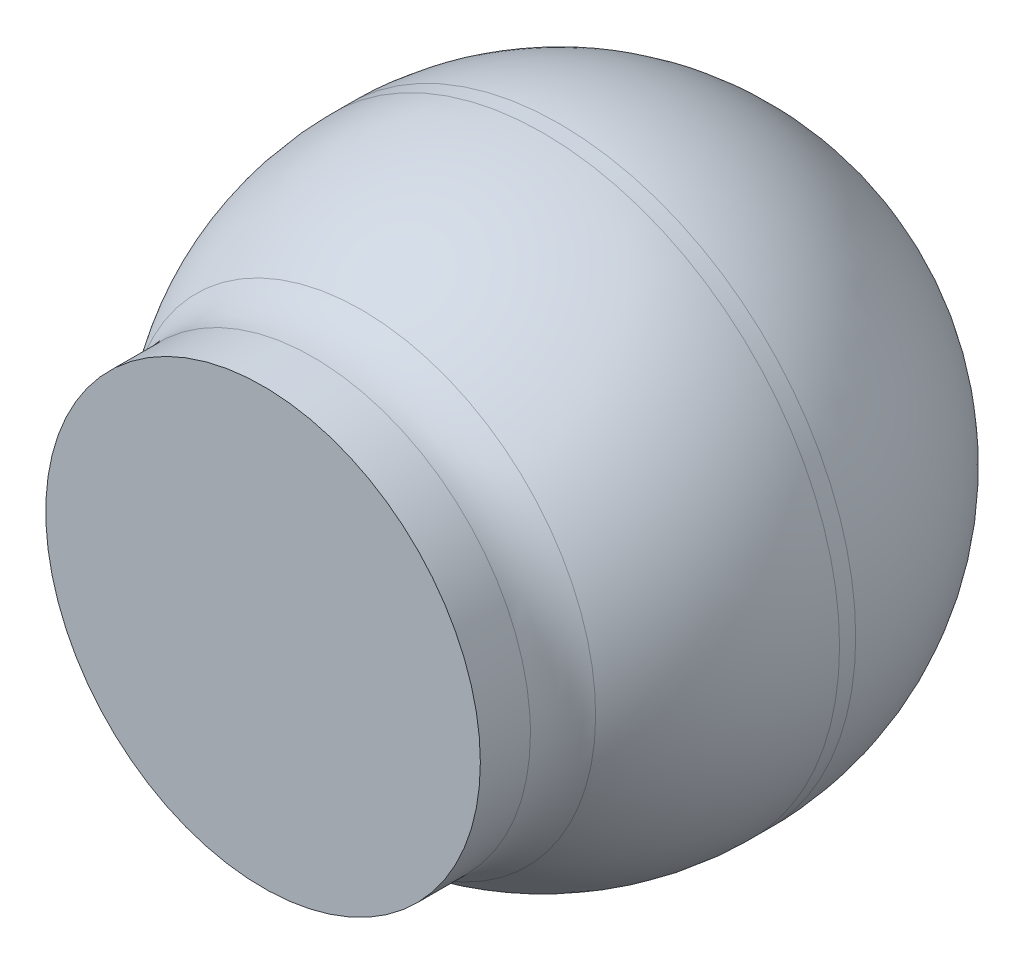
ISO-10303-21;
HEADER;
FILE_DESCRIPTION(('STEP AP214'),'2;1');
FILE_NAME('part.step','',(''),(''),'','','');
FILE_SCHEMA(('AUTOMOTIVE_DESIGN { 1 0 10303 214 1 1 1 1 }'));
ENDSEC;
DATA;
#1=APPLICATION_CONTEXT('core data for automotive mechanical design processes');
#2=APPLICATION_PROTOCOL_DEFINITION('international standard','automotive_design',2000,#1);
#3=PRODUCT_CONTEXT('',#1,'mechanical');
#4=PRODUCT('Part','Part','',(#3));
#5=PRODUCT_RELATED_PRODUCT_CATEGORY('part','',(#4));
#6=PRODUCT_DEFINITION_FORMATION('','',#4);
#7=PRODUCT_DEFINITION_CONTEXT('part definition',#1,'design');
#8=PRODUCT_DEFINITION('design','',#6,#7);
#9=PRODUCT_DEFINITION_SHAPE('','',#8);
#10=(LENGTH_UNIT() NAMED_UNIT(*) SI_UNIT(.MILLI.,.METRE.));
#11=(NAMED_UNIT(*) PLANE_ANGLE_UNIT() SI_UNIT($,.RADIAN.));
#12=(NAMED_UNIT(*) SI_UNIT($,.STERADIAN.) SOLID_ANGLE_UNIT());
#13=UNCERTAINTY_MEASURE_WITH_UNIT(LENGTH_MEASURE(1.E-05),#10,'distance_accuracy_value','');
#14=(GEOMETRIC_REPRESENTATION_CONTEXT(3) GLOBAL_UNCERTAINTY_ASSIGNED_CONTEXT((#13)) GLOBAL_UNIT_ASSIGNED_CONTEXT((#10,
#11,#12)) REPRESENTATION_CONTEXT('',''));
#15=CARTESIAN_POINT('',(0.,0.,0.));
#16=DIRECTION('',(0.,0.,1.));
#17=DIRECTION('',(1.,0.,0.));
#18=AXIS2_PLACEMENT_3D('',#15,#16,#17);
#19=CARTESIAN_POINT('',(-3.102919922269,-5.321349291452,10.006534503384));
#20=DIRECTION('',(0.,0.,-1.));
#21=DIRECTION('',(-1.,0.,0.));
#22=AXIS2_PLACEMENT_3D('',#19,#20,#21);
#23=PLANE('',#22);
#24=CARTESIAN_POINT('',(-3.102919922269,-5.321349291452,10.006534503384));
#25=DIRECTION('',(0.,0.,1.));
#26=DIRECTION('',(1.,0.,0.));
#27=AXIS2_PLACEMENT_3D('',#24,#25,#26);
#28=CIRCLE('',#27,0.275);
#29=CARTESIAN_POINT('',(-2.827919922269,-5.321349291452,10.006534503384));
#30=VERTEX_POINT('',#29);
#31=EDGE_CURVE('E20',#30,#30,#28,.F.);
#32=ORIENTED_EDGE('',*,*,#31,.F.);
#33=EDGE_LOOP('',(#32));
#34=FACE_BOUND('',#33,.T.);
#35=ADVANCED_FACE('F17',(#34),#23,.F.);
#36=CARTESIAN_POINT('',(-3.102919922269,-5.321349291452,9.906534503384));
#37=DIRECTION('',(0.,0.,1.));
#38=DIRECTION('',(1.,0.,0.));
#39=AXIS2_PLACEMENT_3D('',#36,#37,#38);
#40=CYLINDRICAL_SURFACE('',#39,0.275);
#41=CARTESIAN_POINT('',(-3.102919922269,-5.321349291452,9.943180457728));
#42=DIRECTION('',(0.,0.,-1.));
#43=DIRECTION('',(0.996700902337583,0.0811622527992439,0.));
#44=AXIS2_PLACEMENT_3D('',#41,#42,#43);
#45=CIRCLE('',#44,0.275);
#46=CARTESIAN_POINT('',(-2.82882717412616,-5.29902967193221,9.943180457728));
#47=VERTEX_POINT('',#46);
#48=EDGE_CURVE('E65',#47,#47,#45,.F.);
#49=ORIENTED_EDGE('',*,*,#48,.T.);
#50=EDGE_LOOP('',(#49));
#51=FACE_BOUND('',#50,.T.);
#52=ORIENTED_EDGE('',*,*,#31,.T.);
#53=EDGE_LOOP('',(#52));
#54=FACE_BOUND('',#53,.T.);
#55=ADVANCED_FACE('F62',(#51,#54),#40,.T.);
#56=CARTESIAN_POINT('',(-3.102919922269,-5.321349291452,9.943180457728));
#57=DIRECTION('',(0.,0.,-1.));
#58=DIRECTION('',(0.996700902337583,0.0811622527992448,0.));
#59=AXIS2_PLACEMENT_3D('',#56,#57,#58);
#60=TOROIDAL_SURFACE('',#59,0.375,0.1);
#61=ORIENTED_EDGE('',*,*,#48,.F.);
#62=EDGE_LOOP('',(#61));
#63=FACE_BOUND('',#62,.T.);
#64=CARTESIAN_POINT('',(-3.102919922269,-5.321349291452,9.881744931236));
#65=DIRECTION('',(0.,0.,-1.));
#66=DIRECTION('',(-0.996700902337598,-0.0811622527990621,0.));
#67=AXIS2_PLACEMENT_3D('',#64,#65,#66);
#68=CIRCLE('',#67,0.296097046412665);
#69=CARTESIAN_POINT('',(-3.398040115608,-5.345381194786,9.881744931236));
#70=VERTEX_POINT('',#69);
#71=EDGE_CURVE('E39',#70,#70,#68,.T.);
#72=ORIENTED_EDGE('',*,*,#71,.F.);
#73=EDGE_LOOP('',(#72));
#74=FACE_BOUND('',#73,.T.);
#75=ADVANCED_FACE('F57',(#63,#74),#60,.F.);
#76=CARTESIAN_POINT('',(-3.476682760645,-5.351785136252,9.651976062157));
#77=CARTESIAN_POINT('',(-3.476682760645,-5.351785136252,9.701461392103));
#78=CARTESIAN_POINT('',(-3.468526217348,-5.351120941579,9.750947004335));
#79=CARTESIAN_POINT('',(-3.452207085349,-5.349792059952,9.798626332798));
#80=CARTESIAN_POINT('',(-3.428341390838,-5.347848654938,9.842699544317));
#81=CARTESIAN_POINT('',(-3.398040115608,-5.345381194786,9.881744931236));
#82=(BOUNDED_CURVE() B_SPLINE_CURVE(5,(#76,#77,#78,#79,#80,#81),.UNSPECIFIED.,.F.,
.F.) B_SPLINE_CURVE_WITH_KNOTS((6,6),(0.,0.661568582165),
.UNSPECIFIED.) CURVE() GEOMETRIC_REPRESENTATION_ITEM() RATIONAL_B_SPLINE_CURVE((1.,1.,1.,1.,1.,1.)) REPRESENTATION_ITEM(''));
#83=CARTESIAN_POINT('',(-3.102919922269,-5.321349291452,9.651976062157));
#84=DIRECTION('',(0.,0.,-1.));
#85=AXIS1_PLACEMENT('',#83,#84);
#86=SURFACE_OF_REVOLUTION('',#82,#85);
#87=CARTESIAN_POINT('',(-3.102919922269,-5.321349291452,9.651976062157));
#88=DIRECTION('',(0.,0.,1.));
#89=DIRECTION('',(1.,0.,0.));
#90=AXIS2_PLACEMENT_3D('',#87,#88,#89);
#91=CIRCLE('',#90,0.375);
#92=CARTESIAN_POINT('',(-2.727919922269,-5.321349291452,9.651976062157));
#93=VERTEX_POINT('',#92);
#94=EDGE_CURVE('E36',#93,#93,#91,.F.);
#95=ORIENTED_EDGE('',*,*,#94,.F.);
#96=EDGE_LOOP('',(#95));
#97=FACE_BOUND('',#96,.T.);
#98=ORIENTED_EDGE('',*,*,#71,.T.);
#99=EDGE_LOOP('',(#98));
#100=FACE_BOUND('',#99,.T.);
#101=ADVANCED_FACE('F53',(#97,#100),#86,.F.);
#102=CARTESIAN_POINT('',(-3.102919922269,-5.321349291452,9.256534503384));
#103=DIRECTION('',(0.,0.,1.));
#104=DIRECTION('',(1.,0.,0.));
#105=AXIS2_PLACEMENT_3D('',#102,#103,#104);
#106=CYLINDRICAL_SURFACE('',#105,0.375);
#107=CARTESIAN_POINT('',(-3.102919922269,-5.321349291452,9.631534503384));
#108=DIRECTION('',(0.,0.,-1.));
#109=DIRECTION('',(0.0811622527992357,-0.996700902337583,0.));
#110=AXIS2_PLACEMENT_3D('',#107,#108,#109);
#111=CIRCLE('',#110,0.375);
#112=CARTESIAN_POINT('',(-3.07248407746929,-5.69511212982859,9.631534503384));
#113=VERTEX_POINT('',#112);
#114=CARTESIAN_POINT('',(-3.13335576706871,-4.94758645307541,9.631534503384));
#115=VERTEX_POINT('',#114);
#116=EDGE_CURVE('E11',#113,#115,#111,.T.);
#117=ORIENTED_EDGE('',*,*,#116,.F.);
#118=CARTESIAN_POINT('',(-3.102919922269,-5.321349291452,9.631534503384));
#119=DIRECTION('',(0.,0.,1.));
#120=DIRECTION('',(0.0811622527992365,-0.996700902337583,0.));
#121=AXIS2_PLACEMENT_3D('',#118,#119,#120);
#122=CIRCLE('',#121,0.375);
#123=EDGE_CURVE('E25',#115,#113,#122,.F.);
#124=ORIENTED_EDGE('',*,*,#123,.F.);
#125=EDGE_LOOP('',(#117,#124));
#126=FACE_BOUND('',#125,.T.);
#127=ORIENTED_EDGE('',*,*,#94,.T.);
#128=EDGE_LOOP('',(#127));
#129=FACE_BOUND('',#128,.T.);
#130=ADVANCED_FACE('F34',(#126,#129),#106,.T.);
#131=CARTESIAN_POINT('',(-3.102919922269,-5.321349291452,9.631534503384));
#132=DIRECTION('',(0.0811622527992361,-0.996700902337583,0.));
#133=DIRECTION('',(-0.996700902337583,-0.0811622527992361,0.));
#134=AXIS2_PLACEMENT_3D('',#131,#132,#133);
#135=SPHERICAL_SURFACE('',#134,0.375);
#136=ORIENTED_EDGE('',*,*,#123,.T.);
#137=ORIENTED_EDGE('',*,*,#116,.T.);
#138=EDGE_LOOP('',(#136,#137));
#139=FACE_BOUND('',#138,.T.);
#140=ADVANCED_FACE('F32',(#139),#135,.T.);
#141=CLOSED_SHELL('',(#35,#55,#75,#101,#130,#140));
#142=MANIFOLD_SOLID_BREP('B1',#141);
#143=ADVANCED_BREP_SHAPE_REPRESENTATION('',(#18,#142),#14);
#144=SHAPE_DEFINITION_REPRESENTATION(#9,#143);
ENDSEC;
END-ISO-10303-21;
